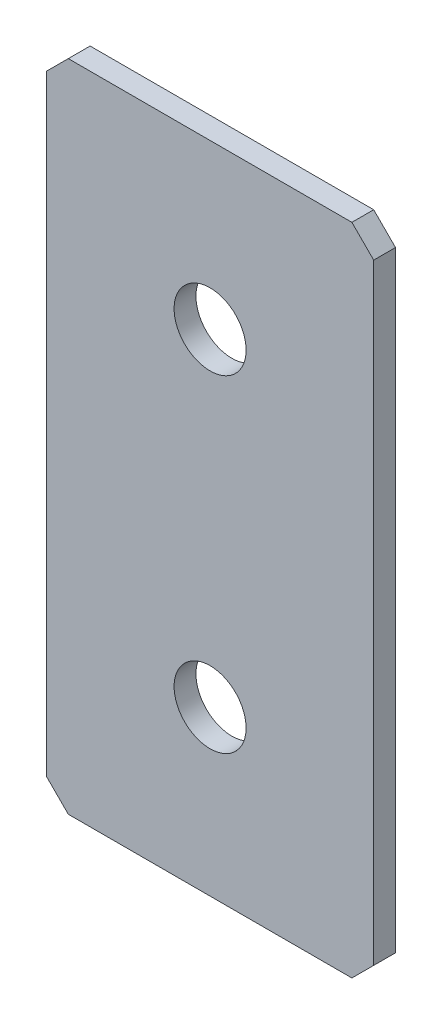
ISO-10303-21;
HEADER;
FILE_DESCRIPTION(('STEP AP214'),'2;1');
FILE_NAME('part.step','',(''),(''),'','','');
FILE_SCHEMA(('AUTOMOTIVE_DESIGN { 1 0 10303 214 1 1 1 1 }'));
ENDSEC;
DATA;
#1=APPLICATION_CONTEXT('core data for automotive mechanical design processes');
#2=APPLICATION_PROTOCOL_DEFINITION('international standard','automotive_design',2000,#1);
#3=PRODUCT_CONTEXT('',#1,'mechanical');
#4=PRODUCT('Part','Part','',(#3));
#5=PRODUCT_RELATED_PRODUCT_CATEGORY('part','',(#4));
#6=PRODUCT_DEFINITION_FORMATION('','',#4);
#7=PRODUCT_DEFINITION_CONTEXT('part definition',#1,'design');
#8=PRODUCT_DEFINITION('design','',#6,#7);
#9=PRODUCT_DEFINITION_SHAPE('','',#8);
#10=(LENGTH_UNIT() NAMED_UNIT(*) SI_UNIT(.MILLI.,.METRE.));
#11=(NAMED_UNIT(*) PLANE_ANGLE_UNIT() SI_UNIT($,.RADIAN.));
#12=(NAMED_UNIT(*) SI_UNIT($,.STERADIAN.) SOLID_ANGLE_UNIT());
#13=UNCERTAINTY_MEASURE_WITH_UNIT(LENGTH_MEASURE(1.E-05),#10,'distance_accuracy_value','');
#14=(GEOMETRIC_REPRESENTATION_CONTEXT(3) GLOBAL_UNCERTAINTY_ASSIGNED_CONTEXT((#13)) GLOBAL_UNIT_ASSIGNED_CONTEXT((#10,
#11,#12)) REPRESENTATION_CONTEXT('',''));
#15=CARTESIAN_POINT('',(0.,0.,0.));
#16=DIRECTION('',(0.,0.,1.));
#17=DIRECTION('',(1.,0.,0.));
#18=AXIS2_PLACEMENT_3D('',#15,#16,#17);
#19=CARTESIAN_POINT('',(15.,-30.,2.));
#20=DIRECTION('',(-1.,0.,0.));
#21=DIRECTION('',(0.,0.,1.));
#22=AXIS2_PLACEMENT_3D('',#19,#20,#21);
#23=PLANE('',#22);
#24=DIRECTION('',(0.,1.,0.));
#25=VECTOR('',#24,1.);
#26=CARTESIAN_POINT('',(15.,-30.,2.));
#27=LINE('',#26,#25);
#28=CARTESIAN_POINT('',(15.,-28.,2.));
#29=VERTEX_POINT('',#28);
#30=CARTESIAN_POINT('',(15.,28.,2.));
#31=VERTEX_POINT('',#30);
#32=EDGE_CURVE('E128',#29,#31,#27,.T.);
#33=ORIENTED_EDGE('',*,*,#32,.F.);
#34=DIRECTION('',(0.,0.,-1.));
#35=VECTOR('',#34,1.);
#36=CARTESIAN_POINT('',(15.,-28.,2.));
#37=LINE('',#36,#35);
#38=CARTESIAN_POINT('',(15.,-28.,0.));
#39=VERTEX_POINT('',#38);
#40=EDGE_CURVE('E154',#29,#39,#37,.T.);
#41=ORIENTED_EDGE('',*,*,#40,.T.);
#42=DIRECTION('',(0.,1.,0.));
#43=VECTOR('',#42,1.);
#44=CARTESIAN_POINT('',(15.,-30.,0.));
#45=LINE('',#44,#43);
#46=CARTESIAN_POINT('',(15.,28.,0.));
#47=VERTEX_POINT('',#46);
#48=EDGE_CURVE('E162',#39,#47,#45,.T.);
#49=ORIENTED_EDGE('',*,*,#48,.T.);
#50=DIRECTION('',(0.,0.,1.));
#51=VECTOR('',#50,1.);
#52=CARTESIAN_POINT('',(15.,28.,2.));
#53=LINE('',#52,#51);
#54=EDGE_CURVE('E152',#47,#31,#53,.T.);
#55=ORIENTED_EDGE('',*,*,#54,.T.);
#56=EDGE_LOOP('',(#33,#41,#49,#55));
#57=FACE_BOUND('',#56,.T.);
#58=ADVANCED_FACE('F37',(#57),#23,.F.);
#59=CARTESIAN_POINT('',(-15.,30.,2.));
#60=DIRECTION('',(0.,-1.,0.));
#61=DIRECTION('',(0.,0.,-1.));
#62=AXIS2_PLACEMENT_3D('',#59,#60,#61);
#63=PLANE('',#62);
#64=DIRECTION('',(-1.,0.,0.));
#65=VECTOR('',#64,1.);
#66=CARTESIAN_POINT('',(-15.,30.,0.));
#67=LINE('',#66,#65);
#68=CARTESIAN_POINT('',(13.,30.,0.));
#69=VERTEX_POINT('',#68);
#70=CARTESIAN_POINT('',(-13.,30.,0.));
#71=VERTEX_POINT('',#70);
#72=EDGE_CURVE('E133',#69,#71,#67,.T.);
#73=ORIENTED_EDGE('',*,*,#72,.T.);
#74=DIRECTION('',(0.,0.,1.));
#75=VECTOR('',#74,1.);
#76=CARTESIAN_POINT('',(-13.,30.,2.));
#77=LINE('',#76,#75);
#78=CARTESIAN_POINT('',(-13.,30.,2.));
#79=VERTEX_POINT('',#78);
#80=EDGE_CURVE('E11',#71,#79,#77,.T.);
#81=ORIENTED_EDGE('',*,*,#80,.T.);
#82=DIRECTION('',(-1.,0.,0.));
#83=VECTOR('',#82,1.);
#84=CARTESIAN_POINT('',(-15.,30.,2.));
#85=LINE('',#84,#83);
#86=CARTESIAN_POINT('',(13.,30.,2.));
#87=VERTEX_POINT('',#86);
#88=EDGE_CURVE('E131',#87,#79,#85,.T.);
#89=ORIENTED_EDGE('',*,*,#88,.F.);
#90=DIRECTION('',(0.,0.,-1.));
#91=VECTOR('',#90,1.);
#92=CARTESIAN_POINT('',(13.,30.,2.));
#93=LINE('',#92,#91);
#94=EDGE_CURVE('E45',#87,#69,#93,.T.);
#95=ORIENTED_EDGE('',*,*,#94,.T.);
#96=EDGE_LOOP('',(#73,#81,#89,#95));
#97=FACE_BOUND('',#96,.T.);
#98=ADVANCED_FACE('F159',(#97),#63,.F.);
#99=CARTESIAN_POINT('',(-15.,-30.,2.));
#100=DIRECTION('',(1.,0.,0.));
#101=DIRECTION('',(0.,0.,-1.));
#102=AXIS2_PLACEMENT_3D('',#99,#100,#101);
#103=PLANE('',#102);
#104=DIRECTION('',(0.,-1.,0.));
#105=VECTOR('',#104,1.);
#106=CARTESIAN_POINT('',(-15.,-30.,0.));
#107=LINE('',#106,#105);
#108=CARTESIAN_POINT('',(-15.,28.,0.));
#109=VERTEX_POINT('',#108);
#110=CARTESIAN_POINT('',(-15.,-28.,0.));
#111=VERTEX_POINT('',#110);
#112=EDGE_CURVE('E129',#109,#111,#107,.T.);
#113=ORIENTED_EDGE('',*,*,#112,.T.);
#114=DIRECTION('',(0.,0.,1.));
#115=VECTOR('',#114,1.);
#116=CARTESIAN_POINT('',(-15.,-28.,2.));
#117=LINE('',#116,#115);
#118=CARTESIAN_POINT('',(-15.,-28.,2.));
#119=VERTEX_POINT('',#118);
#120=EDGE_CURVE('E107',#111,#119,#117,.T.);
#121=ORIENTED_EDGE('',*,*,#120,.T.);
#122=DIRECTION('',(0.,-1.,0.));
#123=VECTOR('',#122,1.);
#124=CARTESIAN_POINT('',(-15.,-30.,2.));
#125=LINE('',#124,#123);
#126=CARTESIAN_POINT('',(-15.,28.,2.));
#127=VERTEX_POINT('',#126);
#128=EDGE_CURVE('E167',#127,#119,#125,.T.);
#129=ORIENTED_EDGE('',*,*,#128,.F.);
#130=DIRECTION('',(0.,0.,-1.));
#131=VECTOR('',#130,1.);
#132=CARTESIAN_POINT('',(-15.,28.,2.));
#133=LINE('',#132,#131);
#134=EDGE_CURVE('E112',#127,#109,#133,.T.);
#135=ORIENTED_EDGE('',*,*,#134,.T.);
#136=EDGE_LOOP('',(#113,#121,#129,#135));
#137=FACE_BOUND('',#136,.T.);
#138=ADVANCED_FACE('F194',(#137),#103,.F.);
#139=CARTESIAN_POINT('',(-15.,-30.,2.));
#140=DIRECTION('',(0.,1.,0.));
#141=DIRECTION('',(0.,0.,1.));
#142=AXIS2_PLACEMENT_3D('',#139,#140,#141);
#143=PLANE('',#142);
#144=DIRECTION('',(1.,0.,0.));
#145=VECTOR('',#144,1.);
#146=CARTESIAN_POINT('',(-15.,-30.,2.));
#147=LINE('',#146,#145);
#148=CARTESIAN_POINT('',(-13.,-30.,2.));
#149=VERTEX_POINT('',#148);
#150=CARTESIAN_POINT('',(13.,-30.,2.));
#151=VERTEX_POINT('',#150);
#152=EDGE_CURVE('E122',#149,#151,#147,.T.);
#153=ORIENTED_EDGE('',*,*,#152,.F.);
#154=DIRECTION('',(0.,0.,-1.));
#155=VECTOR('',#154,1.);
#156=CARTESIAN_POINT('',(-13.,-30.,2.));
#157=LINE('',#156,#155);
#158=CARTESIAN_POINT('',(-13.,-30.,0.));
#159=VERTEX_POINT('',#158);
#160=EDGE_CURVE('E106',#149,#159,#157,.T.);
#161=ORIENTED_EDGE('',*,*,#160,.T.);
#162=DIRECTION('',(1.,0.,0.));
#163=VECTOR('',#162,1.);
#164=CARTESIAN_POINT('',(-15.,-30.,0.));
#165=LINE('',#164,#163);
#166=CARTESIAN_POINT('',(13.,-30.,0.));
#167=VERTEX_POINT('',#166);
#168=EDGE_CURVE('E119',#159,#167,#165,.T.);
#169=ORIENTED_EDGE('',*,*,#168,.T.);
#170=DIRECTION('',(0.,0.,1.));
#171=VECTOR('',#170,1.);
#172=CARTESIAN_POINT('',(13.,-30.,2.));
#173=LINE('',#172,#171);
#174=EDGE_CURVE('E124',#167,#151,#173,.T.);
#175=ORIENTED_EDGE('',*,*,#174,.T.);
#176=EDGE_LOOP('',(#153,#161,#169,#175));
#177=FACE_BOUND('',#176,.T.);
#178=ADVANCED_FACE('F118',(#177),#143,.F.);
#179=CARTESIAN_POINT('',(0.,0.,2.));
#180=DIRECTION('',(0.,0.,-1.));
#181=DIRECTION('',(-1.,0.,0.));
#182=AXIS2_PLACEMENT_3D('',#179,#180,#181);
#183=PLANE('',#182);
#184=CARTESIAN_POINT('',(0.,15.,2.));
#185=DIRECTION('',(0.,0.,1.));
#186=DIRECTION('',(1.,0.,0.));
#187=AXIS2_PLACEMENT_3D('',#184,#185,#186);
#188=CIRCLE('',#187,3.3);
#189=CARTESIAN_POINT('',(3.3,15.,2.));
#190=VERTEX_POINT('',#189);
#191=EDGE_CURVE('E179',#190,#190,#188,.T.);
#192=ORIENTED_EDGE('',*,*,#191,.F.);
#193=EDGE_LOOP('',(#192));
#194=FACE_BOUND('',#193,.T.);
#195=CARTESIAN_POINT('',(0.,-15.,2.));
#196=DIRECTION('',(0.,0.,1.));
#197=DIRECTION('',(1.,0.,0.));
#198=AXIS2_PLACEMENT_3D('',#195,#196,#197);
#199=CIRCLE('',#198,3.3);
#200=CARTESIAN_POINT('',(3.30000000000001,-15.,2.));
#201=VERTEX_POINT('',#200);
#202=EDGE_CURVE('E173',#201,#201,#199,.T.);
#203=ORIENTED_EDGE('',*,*,#202,.F.);
#204=EDGE_LOOP('',(#203));
#205=FACE_BOUND('',#204,.T.);
#206=ORIENTED_EDGE('',*,*,#128,.T.);
#207=DIRECTION('',(-0.707106781186546,0.707106781186549,0.));
#208=VECTOR('',#207,1.);
#209=CARTESIAN_POINT('',(-13.,-30.,2.));
#210=LINE('',#209,#208);
#211=EDGE_CURVE('E150',#119,#149,#210,.F.);
#212=ORIENTED_EDGE('',*,*,#211,.T.);
#213=ORIENTED_EDGE('',*,*,#152,.T.);
#214=DIRECTION('',(-0.707106781186548,-0.707106781186548,0.));
#215=VECTOR('',#214,1.);
#216=CARTESIAN_POINT('',(15.,-28.,2.));
#217=LINE('',#216,#215);
#218=EDGE_CURVE('E148',#151,#29,#217,.F.);
#219=ORIENTED_EDGE('',*,*,#218,.T.);
#220=ORIENTED_EDGE('',*,*,#32,.T.);
#221=DIRECTION('',(0.707106781186546,-0.707106781186549,0.));
#222=VECTOR('',#221,1.);
#223=CARTESIAN_POINT('',(13.,30.,2.));
#224=LINE('',#223,#222);
#225=EDGE_CURVE('E57',#31,#87,#224,.F.);
#226=ORIENTED_EDGE('',*,*,#225,.T.);
#227=ORIENTED_EDGE('',*,*,#88,.T.);
#228=DIRECTION('',(0.707106781186548,0.707106781186548,0.));
#229=VECTOR('',#228,1.);
#230=CARTESIAN_POINT('',(-15.,28.,2.));
#231=LINE('',#230,#229);
#232=EDGE_CURVE('E146',#79,#127,#231,.F.);
#233=ORIENTED_EDGE('',*,*,#232,.T.);
#234=EDGE_LOOP('',(#206,#212,#213,#219,#220,#226,#227,#233));
#235=FACE_BOUND('',#234,.T.);
#236=ADVANCED_FACE('F185',(#194,#205,#235),#183,.F.);
#237=CARTESIAN_POINT('',(0.,0.,0.));
#238=DIRECTION('',(0.,0.,-1.));
#239=DIRECTION('',(-1.,0.,0.));
#240=AXIS2_PLACEMENT_3D('',#237,#238,#239);
#241=PLANE('',#240);
#242=CARTESIAN_POINT('',(0.,15.,0.));
#243=DIRECTION('',(0.,0.,1.));
#244=DIRECTION('',(1.,0.,0.));
#245=AXIS2_PLACEMENT_3D('',#242,#243,#244);
#246=CIRCLE('',#245,3.3);
#247=CARTESIAN_POINT('',(3.3,15.,0.));
#248=VERTEX_POINT('',#247);
#249=EDGE_CURVE('E176',#248,#248,#246,.T.);
#250=ORIENTED_EDGE('',*,*,#249,.T.);
#251=EDGE_LOOP('',(#250));
#252=FACE_BOUND('',#251,.T.);
#253=CARTESIAN_POINT('',(0.,-15.,0.));
#254=DIRECTION('',(0.,0.,1.));
#255=DIRECTION('',(1.,0.,0.));
#256=AXIS2_PLACEMENT_3D('',#253,#254,#255);
#257=CIRCLE('',#256,3.3);
#258=CARTESIAN_POINT('',(3.30000000000001,-15.,0.));
#259=VERTEX_POINT('',#258);
#260=EDGE_CURVE('E163',#259,#259,#257,.T.);
#261=ORIENTED_EDGE('',*,*,#260,.T.);
#262=EDGE_LOOP('',(#261));
#263=FACE_BOUND('',#262,.T.);
#264=ORIENTED_EDGE('',*,*,#168,.F.);
#265=DIRECTION('',(0.707106781186546,-0.707106781186549,0.));
#266=VECTOR('',#265,1.);
#267=CARTESIAN_POINT('',(-21.5,-21.5,0.));
#268=LINE('',#267,#266);
#269=EDGE_CURVE('E102',#159,#111,#268,.F.);
#270=ORIENTED_EDGE('',*,*,#269,.T.);
#271=ORIENTED_EDGE('',*,*,#112,.F.);
#272=DIRECTION('',(-0.707106781186548,-0.707106781186548,0.));
#273=VECTOR('',#272,1.);
#274=CARTESIAN_POINT('',(-21.5,21.5,0.));
#275=LINE('',#274,#273);
#276=EDGE_CURVE('E139',#109,#71,#275,.F.);
#277=ORIENTED_EDGE('',*,*,#276,.T.);
#278=ORIENTED_EDGE('',*,*,#72,.F.);
#279=DIRECTION('',(-0.707106781186546,0.707106781186549,0.));
#280=VECTOR('',#279,1.);
#281=CARTESIAN_POINT('',(21.5,21.4999999999999,0.));
#282=LINE('',#281,#280);
#283=EDGE_CURVE('E123',#69,#47,#282,.F.);
#284=ORIENTED_EDGE('',*,*,#283,.T.);
#285=ORIENTED_EDGE('',*,*,#48,.F.);
#286=DIRECTION('',(0.707106781186548,0.707106781186548,0.));
#287=VECTOR('',#286,1.);
#288=CARTESIAN_POINT('',(21.5,-21.5,0.));
#289=LINE('',#288,#287);
#290=EDGE_CURVE('E113',#39,#167,#289,.F.);
#291=ORIENTED_EDGE('',*,*,#290,.T.);
#292=EDGE_LOOP('',(#264,#270,#271,#277,#278,#284,#285,#291));
#293=FACE_BOUND('',#292,.T.);
#294=ADVANCED_FACE('F126',(#252,#263,#293),#241,.T.);
#295=CARTESIAN_POINT('',(-13.,-30.,2.));
#296=DIRECTION('',(0.707106781186549,0.707106781186546,0.));
#297=DIRECTION('',(0.,0.,-1.));
#298=AXIS2_PLACEMENT_3D('',#295,#296,#297);
#299=PLANE('',#298);
#300=ORIENTED_EDGE('',*,*,#211,.F.);
#301=ORIENTED_EDGE('',*,*,#120,.F.);
#302=ORIENTED_EDGE('',*,*,#269,.F.);
#303=ORIENTED_EDGE('',*,*,#160,.F.);
#304=EDGE_LOOP('',(#300,#301,#302,#303));
#305=FACE_BOUND('',#304,.T.);
#306=ADVANCED_FACE('F105',(#305),#299,.F.);
#307=CARTESIAN_POINT('',(15.,-28.,2.));
#308=DIRECTION('',(-0.707106781186547,0.707106781186547,0.));
#309=DIRECTION('',(0.,0.,-1.));
#310=AXIS2_PLACEMENT_3D('',#307,#308,#309);
#311=PLANE('',#310);
#312=ORIENTED_EDGE('',*,*,#218,.F.);
#313=ORIENTED_EDGE('',*,*,#174,.F.);
#314=ORIENTED_EDGE('',*,*,#290,.F.);
#315=ORIENTED_EDGE('',*,*,#40,.F.);
#316=EDGE_LOOP('',(#312,#313,#314,#315));
#317=FACE_BOUND('',#316,.T.);
#318=ADVANCED_FACE('F198',(#317),#311,.F.);
#319=CARTESIAN_POINT('',(-15.,28.,2.));
#320=DIRECTION('',(0.707106781186547,-0.707106781186547,0.));
#321=DIRECTION('',(0.,0.,-1.));
#322=AXIS2_PLACEMENT_3D('',#319,#320,#321);
#323=PLANE('',#322);
#324=ORIENTED_EDGE('',*,*,#232,.F.);
#325=ORIENTED_EDGE('',*,*,#80,.F.);
#326=ORIENTED_EDGE('',*,*,#276,.F.);
#327=ORIENTED_EDGE('',*,*,#134,.F.);
#328=EDGE_LOOP('',(#324,#325,#326,#327));
#329=FACE_BOUND('',#328,.T.);
#330=ADVANCED_FACE('F196',(#329),#323,.F.);
#331=CARTESIAN_POINT('',(13.,30.,2.));
#332=DIRECTION('',(-0.707106781186549,-0.707106781186546,0.));
#333=DIRECTION('',(0.,0.,-1.));
#334=AXIS2_PLACEMENT_3D('',#331,#332,#333);
#335=PLANE('',#334);
#336=ORIENTED_EDGE('',*,*,#225,.F.);
#337=ORIENTED_EDGE('',*,*,#54,.F.);
#338=ORIENTED_EDGE('',*,*,#283,.F.);
#339=ORIENTED_EDGE('',*,*,#94,.F.);
#340=EDGE_LOOP('',(#336,#337,#338,#339));
#341=FACE_BOUND('',#340,.T.);
#342=ADVANCED_FACE('F39',(#341),#335,.F.);
#343=CARTESIAN_POINT('',(0.,-15.,2.));
#344=DIRECTION('',(0.,0.,1.));
#345=DIRECTION('',(1.,0.,0.));
#346=AXIS2_PLACEMENT_3D('',#343,#344,#345);
#347=CYLINDRICAL_SURFACE('',#346,3.3);
#348=ORIENTED_EDGE('',*,*,#260,.F.);
#349=EDGE_LOOP('',(#348));
#350=FACE_BOUND('',#349,.T.);
#351=ORIENTED_EDGE('',*,*,#202,.T.);
#352=EDGE_LOOP('',(#351));
#353=FACE_BOUND('',#352,.T.);
#354=ADVANCED_FACE('F203',(#350,#353),#347,.F.);
#355=CARTESIAN_POINT('',(0.,15.,2.));
#356=DIRECTION('',(0.,0.,1.));
#357=DIRECTION('',(1.,0.,0.));
#358=AXIS2_PLACEMENT_3D('',#355,#356,#357);
#359=CYLINDRICAL_SURFACE('',#358,3.3);
#360=ORIENTED_EDGE('',*,*,#249,.F.);
#361=EDGE_LOOP('',(#360));
#362=FACE_BOUND('',#361,.T.);
#363=ORIENTED_EDGE('',*,*,#191,.T.);
#364=EDGE_LOOP('',(#363));
#365=FACE_BOUND('',#364,.T.);
#366=ADVANCED_FACE('F183',(#362,#365),#359,.F.);
#367=CLOSED_SHELL('',(#58,#98,#138,#178,#236,#294,#306,#318,#330,#342,#354,#366));
#368=MANIFOLD_SOLID_BREP('B2',#367);
#369=ADVANCED_BREP_SHAPE_REPRESENTATION('',(#18,#368),#14);
#370=SHAPE_DEFINITION_REPRESENTATION(#9,#369);
ENDSEC;
END-ISO-10303-21;
